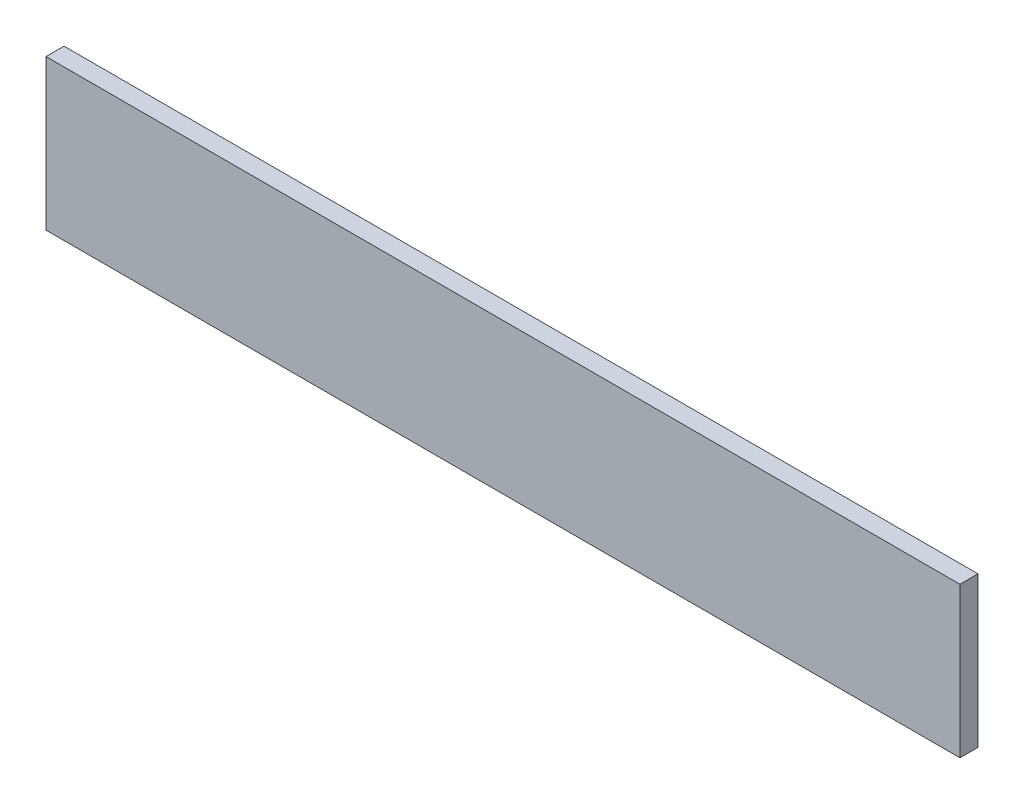
ISO-10303-21;
HEADER;
FILE_DESCRIPTION(('STEP AP214'),'2;1');
FILE_NAME('part.step','',(''),(''),'','','');
FILE_SCHEMA(('AUTOMOTIVE_DESIGN { 1 0 10303 214 1 1 1 1 }'));
ENDSEC;
DATA;
#1=APPLICATION_CONTEXT('core data for automotive mechanical design processes');
#2=APPLICATION_PROTOCOL_DEFINITION('international standard','automotive_design',2000,#1);
#3=PRODUCT_CONTEXT('',#1,'mechanical');
#4=PRODUCT('Part','Part','',(#3));
#5=PRODUCT_RELATED_PRODUCT_CATEGORY('part','',(#4));
#6=PRODUCT_DEFINITION_FORMATION('','',#4);
#7=PRODUCT_DEFINITION_CONTEXT('part definition',#1,'design');
#8=PRODUCT_DEFINITION('design','',#6,#7);
#9=PRODUCT_DEFINITION_SHAPE('','',#8);
#10=(LENGTH_UNIT() NAMED_UNIT(*) SI_UNIT(.MILLI.,.METRE.));
#11=(NAMED_UNIT(*) PLANE_ANGLE_UNIT() SI_UNIT($,.RADIAN.));
#12=(NAMED_UNIT(*) SI_UNIT($,.STERADIAN.) SOLID_ANGLE_UNIT());
#13=UNCERTAINTY_MEASURE_WITH_UNIT(LENGTH_MEASURE(1.E-05),#10,'distance_accuracy_value','');
#14=(GEOMETRIC_REPRESENTATION_CONTEXT(3) GLOBAL_UNCERTAINTY_ASSIGNED_CONTEXT((#13)) GLOBAL_UNIT_ASSIGNED_CONTEXT((#10,
#11,#12)) REPRESENTATION_CONTEXT('',''));
#15=CARTESIAN_POINT('',(0.,0.,0.));
#16=DIRECTION('',(0.,0.,1.));
#17=DIRECTION('',(1.,0.,0.));
#18=AXIS2_PLACEMENT_3D('',#15,#16,#17);
#19=CARTESIAN_POINT('',(380.,-62.5,15.));
#20=DIRECTION('',(-1.,0.,0.));
#21=DIRECTION('',(0.,0.,1.));
#22=AXIS2_PLACEMENT_3D('',#19,#20,#21);
#23=PLANE('',#22);
#24=DIRECTION('',(0.,1.,0.));
#25=VECTOR('',#24,1.);
#26=CARTESIAN_POINT('',(380.,-62.5,0.));
#27=LINE('',#26,#25);
#28=CARTESIAN_POINT('',(380.,-62.5,0.));
#29=VERTEX_POINT('',#28);
#30=CARTESIAN_POINT('',(380.,62.5,0.));
#31=VERTEX_POINT('',#30);
#32=EDGE_CURVE('E96',#29,#31,#27,.T.);
#33=ORIENTED_EDGE('',*,*,#32,.T.);
#34=DIRECTION('',(0.,0.,-1.));
#35=VECTOR('',#34,1.);
#36=CARTESIAN_POINT('',(380.,62.5,15.));
#37=LINE('',#36,#35);
#38=CARTESIAN_POINT('',(380.,62.5,15.));
#39=VERTEX_POINT('',#38);
#40=EDGE_CURVE('E11',#39,#31,#37,.T.);
#41=ORIENTED_EDGE('',*,*,#40,.F.);
#42=DIRECTION('',(0.,1.,0.));
#43=VECTOR('',#42,1.);
#44=CARTESIAN_POINT('',(380.,-62.5,15.));
#45=LINE('',#44,#43);
#46=CARTESIAN_POINT('',(380.,-62.5,15.));
#47=VERTEX_POINT('',#46);
#48=EDGE_CURVE('E84',#47,#39,#45,.T.);
#49=ORIENTED_EDGE('',*,*,#48,.F.);
#50=DIRECTION('',(0.,0.,-1.));
#51=VECTOR('',#50,1.);
#52=CARTESIAN_POINT('',(380.,-62.5,15.));
#53=LINE('',#52,#51);
#54=EDGE_CURVE('E92',#47,#29,#53,.T.);
#55=ORIENTED_EDGE('',*,*,#54,.T.);
#56=EDGE_LOOP('',(#33,#41,#49,#55));
#57=FACE_BOUND('',#56,.T.);
#58=ADVANCED_FACE('F33',(#57),#23,.F.);
#59=CARTESIAN_POINT('',(-380.,62.5,15.));
#60=DIRECTION('',(0.,-1.,0.));
#61=DIRECTION('',(0.,0.,-1.));
#62=AXIS2_PLACEMENT_3D('',#59,#60,#61);
#63=PLANE('',#62);
#64=DIRECTION('',(-1.,0.,0.));
#65=VECTOR('',#64,1.);
#66=CARTESIAN_POINT('',(-380.,62.5,0.));
#67=LINE('',#66,#65);
#68=CARTESIAN_POINT('',(-380.,62.5,0.));
#69=VERTEX_POINT('',#68);
#70=EDGE_CURVE('E88',#31,#69,#67,.T.);
#71=ORIENTED_EDGE('',*,*,#70,.T.);
#72=DIRECTION('',(0.,0.,-1.));
#73=VECTOR('',#72,1.);
#74=CARTESIAN_POINT('',(-380.,62.5,15.));
#75=LINE('',#74,#73);
#76=CARTESIAN_POINT('',(-380.,62.5,15.));
#77=VERTEX_POINT('',#76);
#78=EDGE_CURVE('E41',#77,#69,#75,.T.);
#79=ORIENTED_EDGE('',*,*,#78,.F.);
#80=DIRECTION('',(-1.,0.,0.));
#81=VECTOR('',#80,1.);
#82=CARTESIAN_POINT('',(-380.,62.5,15.));
#83=LINE('',#82,#81);
#84=EDGE_CURVE('E79',#39,#77,#83,.T.);
#85=ORIENTED_EDGE('',*,*,#84,.F.);
#86=ORIENTED_EDGE('',*,*,#40,.T.);
#87=EDGE_LOOP('',(#71,#79,#85,#86));
#88=FACE_BOUND('',#87,.T.);
#89=ADVANCED_FACE('F87',(#88),#63,.F.);
#90=CARTESIAN_POINT('',(-380.,-62.5,15.));
#91=DIRECTION('',(1.,0.,0.));
#92=DIRECTION('',(0.,0.,-1.));
#93=AXIS2_PLACEMENT_3D('',#90,#91,#92);
#94=PLANE('',#93);
#95=DIRECTION('',(0.,-1.,0.));
#96=VECTOR('',#95,1.);
#97=CARTESIAN_POINT('',(-380.,-62.5,0.));
#98=LINE('',#97,#96);
#99=CARTESIAN_POINT('',(-380.,-62.5,0.));
#100=VERTEX_POINT('',#99);
#101=EDGE_CURVE('E66',#69,#100,#98,.T.);
#102=ORIENTED_EDGE('',*,*,#101,.T.);
#103=DIRECTION('',(0.,0.,-1.));
#104=VECTOR('',#103,1.);
#105=CARTESIAN_POINT('',(-380.,-62.5,15.));
#106=LINE('',#105,#104);
#107=CARTESIAN_POINT('',(-380.,-62.5,15.));
#108=VERTEX_POINT('',#107);
#109=EDGE_CURVE('E89',#108,#100,#106,.T.);
#110=ORIENTED_EDGE('',*,*,#109,.F.);
#111=DIRECTION('',(0.,-1.,0.));
#112=VECTOR('',#111,1.);
#113=CARTESIAN_POINT('',(-380.,-62.5,15.));
#114=LINE('',#113,#112);
#115=EDGE_CURVE('E82',#77,#108,#114,.T.);
#116=ORIENTED_EDGE('',*,*,#115,.F.);
#117=ORIENTED_EDGE('',*,*,#78,.T.);
#118=EDGE_LOOP('',(#102,#110,#116,#117));
#119=FACE_BOUND('',#118,.T.);
#120=ADVANCED_FACE('F90',(#119),#94,.F.);
#121=CARTESIAN_POINT('',(-380.,-62.5,15.));
#122=DIRECTION('',(0.,1.,0.));
#123=DIRECTION('',(0.,0.,1.));
#124=AXIS2_PLACEMENT_3D('',#121,#122,#123);
#125=PLANE('',#124);
#126=DIRECTION('',(1.,0.,0.));
#127=VECTOR('',#126,1.);
#128=CARTESIAN_POINT('',(-380.,-62.5,0.));
#129=LINE('',#128,#127);
#130=EDGE_CURVE('E72',#100,#29,#129,.T.);
#131=ORIENTED_EDGE('',*,*,#130,.T.);
#132=ORIENTED_EDGE('',*,*,#54,.F.);
#133=DIRECTION('',(1.,0.,0.));
#134=VECTOR('',#133,1.);
#135=CARTESIAN_POINT('',(-380.,-62.5,15.));
#136=LINE('',#135,#134);
#137=EDGE_CURVE('E49',#108,#47,#136,.T.);
#138=ORIENTED_EDGE('',*,*,#137,.F.);
#139=ORIENTED_EDGE('',*,*,#109,.T.);
#140=EDGE_LOOP('',(#131,#132,#138,#139));
#141=FACE_BOUND('',#140,.T.);
#142=ADVANCED_FACE('F103',(#141),#125,.F.);
#143=CARTESIAN_POINT('',(0.,0.,15.));
#144=DIRECTION('',(0.,0.,-1.));
#145=DIRECTION('',(-1.,0.,0.));
#146=AXIS2_PLACEMENT_3D('',#143,#144,#145);
#147=PLANE('',#146);
#148=ORIENTED_EDGE('',*,*,#48,.T.);
#149=ORIENTED_EDGE('',*,*,#84,.T.);
#150=ORIENTED_EDGE('',*,*,#115,.T.);
#151=ORIENTED_EDGE('',*,*,#137,.T.);
#152=EDGE_LOOP('',(#148,#149,#150,#151));
#153=FACE_BOUND('',#152,.T.);
#154=ADVANCED_FACE('F80',(#153),#147,.F.);
#155=CARTESIAN_POINT('',(0.,0.,0.));
#156=DIRECTION('',(0.,0.,-1.));
#157=DIRECTION('',(-1.,0.,0.));
#158=AXIS2_PLACEMENT_3D('',#155,#156,#157);
#159=PLANE('',#158);
#160=ORIENTED_EDGE('',*,*,#32,.F.);
#161=ORIENTED_EDGE('',*,*,#130,.F.);
#162=ORIENTED_EDGE('',*,*,#101,.F.);
#163=ORIENTED_EDGE('',*,*,#70,.F.);
#164=EDGE_LOOP('',(#160,#161,#162,#163));
#165=FACE_BOUND('',#164,.T.);
#166=ADVANCED_FACE('F106',(#165),#159,.T.);
#167=CLOSED_SHELL('',(#58,#89,#120,#142,#154,#166));
#168=MANIFOLD_SOLID_BREP('B2',#167);
#169=ADVANCED_BREP_SHAPE_REPRESENTATION('',(#18,#168),#14);
#170=SHAPE_DEFINITION_REPRESENTATION(#9,#169);
ENDSEC;
END-ISO-10303-21;
